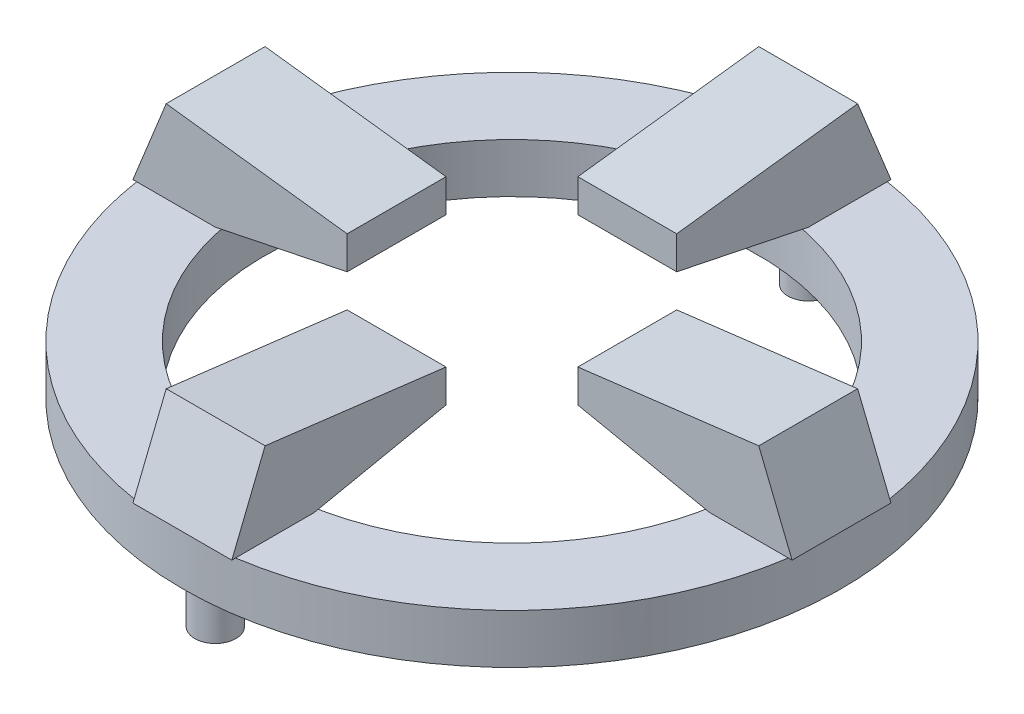
ISO-10303-21;
HEADER;
FILE_DESCRIPTION(('STEP AP214'),'2;1');
FILE_NAME('part.step','',(''),(''),'','','');
FILE_SCHEMA(('AUTOMOTIVE_DESIGN { 1 0 10303 214 1 1 1 1 }'));
ENDSEC;
DATA;
#1=APPLICATION_CONTEXT('core data for automotive mechanical design processes');
#2=APPLICATION_PROTOCOL_DEFINITION('international standard','automotive_design',2000,#1);
#3=PRODUCT_CONTEXT('',#1,'mechanical');
#4=PRODUCT('Part','Part','',(#3));
#5=PRODUCT_RELATED_PRODUCT_CATEGORY('part','',(#4));
#6=PRODUCT_DEFINITION_FORMATION('','',#4);
#7=PRODUCT_DEFINITION_CONTEXT('part definition',#1,'design');
#8=PRODUCT_DEFINITION('design','',#6,#7);
#9=PRODUCT_DEFINITION_SHAPE('','',#8);
#10=(LENGTH_UNIT() NAMED_UNIT(*) SI_UNIT(.MILLI.,.METRE.));
#11=(NAMED_UNIT(*) PLANE_ANGLE_UNIT() SI_UNIT($,.RADIAN.));
#12=(NAMED_UNIT(*) SI_UNIT($,.STERADIAN.) SOLID_ANGLE_UNIT());
#13=UNCERTAINTY_MEASURE_WITH_UNIT(LENGTH_MEASURE(1.E-05),#10,'distance_accuracy_value','');
#14=(GEOMETRIC_REPRESENTATION_CONTEXT(3) GLOBAL_UNCERTAINTY_ASSIGNED_CONTEXT((#13)) GLOBAL_UNIT_ASSIGNED_CONTEXT((#10,
#11,#12)) REPRESENTATION_CONTEXT('',''));
#15=CARTESIAN_POINT('',(0.,0.,0.));
#16=DIRECTION('',(0.,0.,1.));
#17=DIRECTION('',(1.,0.,0.));
#18=AXIS2_PLACEMENT_3D('',#15,#16,#17);
#19=CARTESIAN_POINT('',(0.,3.,0.));
#20=DIRECTION('',(0.,1.,0.));
#21=DIRECTION('',(0.,0.,1.));
#22=AXIS2_PLACEMENT_3D('',#19,#20,#21);
#23=PLANE('',#22);
#24=DIRECTION('',(1.,0.,0.));
#25=VECTOR('',#24,1.);
#26=CARTESIAN_POINT('',(-15.,3.,-3.));
#27=LINE('',#26,#25);
#28=CARTESIAN_POINT('',(-19.7737199332852,3.,-3.));
#29=VERTEX_POINT('',#28);
#30=CARTESIAN_POINT('',(-15.,3.,-3.));
#31=VERTEX_POINT('',#30);
#32=EDGE_CURVE('E61',#29,#31,#27,.T.);
#33=ORIENTED_EDGE('',*,*,#32,.T.);
#34=DIRECTION('',(0.,0.,1.));
#35=VECTOR('',#34,1.);
#36=CARTESIAN_POINT('',(-15.,3.,-3.));
#37=LINE('',#36,#35);
#38=CARTESIAN_POINT('',(-15.,3.,0.));
#39=VERTEX_POINT('',#38);
#40=EDGE_CURVE('E258',#31,#39,#37,.T.);
#41=ORIENTED_EDGE('',*,*,#40,.T.);
#42=CARTESIAN_POINT('',(0.,3.,0.));
#43=DIRECTION('',(0.,1.,0.));
#44=DIRECTION('',(0.,0.,1.));
#45=AXIS2_PLACEMENT_3D('',#42,#43,#44);
#46=CIRCLE('',#45,15.);
#47=CARTESIAN_POINT('',(0.,3.,-15.));
#48=VERTEX_POINT('',#47);
#49=EDGE_CURVE('E491',#48,#39,#46,.T.);
#50=ORIENTED_EDGE('',*,*,#49,.F.);
#51=DIRECTION('',(1.,0.,0.));
#52=VECTOR('',#51,1.);
#53=CARTESIAN_POINT('',(-3.,3.,-15.));
#54=LINE('',#53,#52);
#55=CARTESIAN_POINT('',(-3.,3.,-15.));
#56=VERTEX_POINT('',#55);
#57=EDGE_CURVE('E472',#56,#48,#54,.T.);
#58=ORIENTED_EDGE('',*,*,#57,.F.);
#59=DIRECTION('',(0.,0.,-1.));
#60=VECTOR('',#59,1.);
#61=CARTESIAN_POINT('',(-3.,3.,-15.));
#62=LINE('',#61,#60);
#63=CARTESIAN_POINT('',(-3.,3.,-19.7737199332852));
#64=VERTEX_POINT('',#63);
#65=EDGE_CURVE('E451',#56,#64,#62,.T.);
#66=ORIENTED_EDGE('',*,*,#65,.T.);
#67=CARTESIAN_POINT('',(0.,3.,0.));
#68=DIRECTION('',(0.,1.,0.));
#69=DIRECTION('',(0.,0.,1.));
#70=AXIS2_PLACEMENT_3D('',#67,#68,#69);
#71=CIRCLE('',#70,20.);
#72=EDGE_CURVE('E1092',#64,#29,#71,.T.);
#73=ORIENTED_EDGE('',*,*,#72,.T.);
#74=EDGE_LOOP('',(#33,#41,#50,#58,#66,#73));
#75=FACE_BOUND('',#74,.T.);
#76=ADVANCED_FACE('F45',(#75),#23,.T.);
#77=DIRECTION('',(1.,0.,0.));
#78=VECTOR('',#77,1.);
#79=CARTESIAN_POINT('',(15.,3.,-3.));
#80=LINE('',#79,#78);
#81=CARTESIAN_POINT('',(15.,3.,-3.));
#82=VERTEX_POINT('',#81);
#83=CARTESIAN_POINT('',(19.7737199332852,3.,-3.));
#84=VERTEX_POINT('',#83);
#85=EDGE_CURVE('E321',#82,#84,#80,.T.);
#86=ORIENTED_EDGE('',*,*,#85,.T.);
#87=CARTESIAN_POINT('',(3.,3.,-19.7737199332852));
#88=VERTEX_POINT('',#87);
#89=EDGE_CURVE('E509',#84,#88,#71,.T.);
#90=ORIENTED_EDGE('',*,*,#89,.T.);
#91=DIRECTION('',(0.,0.,-1.));
#92=VECTOR('',#91,1.);
#93=CARTESIAN_POINT('',(3.,3.,-15.));
#94=LINE('',#93,#92);
#95=CARTESIAN_POINT('',(3.,3.,-15.));
#96=VERTEX_POINT('',#95);
#97=EDGE_CURVE('E429',#96,#88,#94,.T.);
#98=ORIENTED_EDGE('',*,*,#97,.F.);
#99=EDGE_CURVE('E478',#48,#96,#54,.T.);
#100=ORIENTED_EDGE('',*,*,#99,.F.);
#101=CARTESIAN_POINT('',(15.,3.,0.));
#102=VERTEX_POINT('',#101);
#103=EDGE_CURVE('E501',#102,#48,#46,.T.);
#104=ORIENTED_EDGE('',*,*,#103,.F.);
#105=DIRECTION('',(0.,0.,1.));
#106=VECTOR('',#105,1.);
#107=CARTESIAN_POINT('',(15.,3.,-3.));
#108=LINE('',#107,#106);
#109=EDGE_CURVE('E341',#82,#102,#108,.T.);
#110=ORIENTED_EDGE('',*,*,#109,.F.);
#111=EDGE_LOOP('',(#86,#90,#98,#100,#104,#110));
#112=FACE_BOUND('',#111,.T.);
#113=ADVANCED_FACE('F528',(#112),#23,.T.);
#114=CARTESIAN_POINT('',(-15.,3.,3.));
#115=VERTEX_POINT('',#114);
#116=EDGE_CURVE('E69',#39,#115,#37,.T.);
#117=ORIENTED_EDGE('',*,*,#116,.T.);
#118=DIRECTION('',(1.,0.,0.));
#119=VECTOR('',#118,1.);
#120=CARTESIAN_POINT('',(-15.,3.,3.));
#121=LINE('',#120,#119);
#122=CARTESIAN_POINT('',(-19.7737199332852,3.,3.));
#123=VERTEX_POINT('',#122);
#124=EDGE_CURVE('E280',#123,#115,#121,.T.);
#125=ORIENTED_EDGE('',*,*,#124,.F.);
#126=CARTESIAN_POINT('',(-3.,3.,19.7737199332852));
#127=VERTEX_POINT('',#126);
#128=EDGE_CURVE('E506',#123,#127,#71,.T.);
#129=ORIENTED_EDGE('',*,*,#128,.T.);
#130=DIRECTION('',(0.,0.,-1.));
#131=VECTOR('',#130,1.);
#132=CARTESIAN_POINT('',(-3.,3.,15.));
#133=LINE('',#132,#131);
#134=CARTESIAN_POINT('',(-3.,3.,15.));
#135=VERTEX_POINT('',#134);
#136=EDGE_CURVE('E386',#127,#135,#133,.T.);
#137=ORIENTED_EDGE('',*,*,#136,.T.);
#138=DIRECTION('',(1.,0.,0.));
#139=VECTOR('',#138,1.);
#140=CARTESIAN_POINT('',(-3.,3.,15.));
#141=LINE('',#140,#139);
#142=CARTESIAN_POINT('',(0.,3.,15.));
#143=VERTEX_POINT('',#142);
#144=EDGE_CURVE('E375',#135,#143,#141,.T.);
#145=ORIENTED_EDGE('',*,*,#144,.T.);
#146=EDGE_CURVE('E496',#39,#143,#46,.T.);
#147=ORIENTED_EDGE('',*,*,#146,.F.);
#148=EDGE_LOOP('',(#117,#125,#129,#137,#145,#147));
#149=FACE_BOUND('',#148,.T.);
#150=ADVANCED_FACE('F579',(#149),#23,.T.);
#151=CARTESIAN_POINT('',(15.,3.,3.));
#152=VERTEX_POINT('',#151);
#153=EDGE_CURVE('E346',#102,#152,#108,.T.);
#154=ORIENTED_EDGE('',*,*,#153,.F.);
#155=EDGE_CURVE('E497',#143,#102,#46,.T.);
#156=ORIENTED_EDGE('',*,*,#155,.F.);
#157=CARTESIAN_POINT('',(3.,3.,15.));
#158=VERTEX_POINT('',#157);
#159=EDGE_CURVE('E379',#143,#158,#141,.T.);
#160=ORIENTED_EDGE('',*,*,#159,.T.);
#161=DIRECTION('',(0.,0.,-1.));
#162=VECTOR('',#161,1.);
#163=CARTESIAN_POINT('',(3.,3.,15.));
#164=LINE('',#163,#162);
#165=CARTESIAN_POINT('',(3.,3.,19.7737199332852));
#166=VERTEX_POINT('',#165);
#167=EDGE_CURVE('E407',#166,#158,#164,.T.);
#168=ORIENTED_EDGE('',*,*,#167,.F.);
#169=CARTESIAN_POINT('',(19.7737199332852,3.,3.));
#170=VERTEX_POINT('',#169);
#171=EDGE_CURVE('E535',#166,#170,#71,.T.);
#172=ORIENTED_EDGE('',*,*,#171,.T.);
#173=DIRECTION('',(1.,0.,0.));
#174=VECTOR('',#173,1.);
#175=CARTESIAN_POINT('',(15.,3.,3.));
#176=LINE('',#175,#174);
#177=EDGE_CURVE('E299',#152,#170,#176,.T.);
#178=ORIENTED_EDGE('',*,*,#177,.F.);
#179=EDGE_LOOP('',(#154,#156,#160,#168,#172,#178));
#180=FACE_BOUND('',#179,.T.);
#181=ADVANCED_FACE('F582',(#180),#23,.T.);
#182=CARTESIAN_POINT('',(0.,0.,0.));
#183=DIRECTION('',(0.,1.,0.));
#184=DIRECTION('',(0.,0.,1.));
#185=AXIS2_PLACEMENT_3D('',#182,#183,#184);
#186=PLANE('',#185);
#187=CARTESIAN_POINT('',(0.,0.,-18.));
#188=DIRECTION('',(0.,1.,0.));
#189=DIRECTION('',(0.,0.,1.));
#190=AXIS2_PLACEMENT_3D('',#187,#188,#189);
#191=CIRCLE('',#190,1.25);
#192=CARTESIAN_POINT('',(0.,0.,-16.75));
#193=VERTEX_POINT('',#192);
#194=EDGE_CURVE('E11',#193,#193,#191,.F.);
#195=ORIENTED_EDGE('',*,*,#194,.F.);
#196=EDGE_LOOP('',(#195));
#197=FACE_BOUND('',#196,.T.);
#198=CARTESIAN_POINT('',(0.,0.,18.));
#199=DIRECTION('',(0.,1.,0.));
#200=DIRECTION('',(0.,0.,1.));
#201=AXIS2_PLACEMENT_3D('',#198,#199,#200);
#202=CIRCLE('',#201,1.25);
#203=CARTESIAN_POINT('',(0.,0.,19.25));
#204=VERTEX_POINT('',#203);
#205=EDGE_CURVE('E54',#204,#204,#202,.F.);
#206=ORIENTED_EDGE('',*,*,#205,.F.);
#207=EDGE_LOOP('',(#206));
#208=FACE_BOUND('',#207,.T.);
#209=CARTESIAN_POINT('',(0.,0.,0.));
#210=DIRECTION('',(0.,1.,0.));
#211=DIRECTION('',(0.,0.,1.));
#212=AXIS2_PLACEMENT_3D('',#209,#210,#211);
#213=CIRCLE('',#212,20.);
#214=CARTESIAN_POINT('',(0.,0.,20.));
#215=VERTEX_POINT('',#214);
#216=EDGE_CURVE('E495',#215,#215,#213,.T.);
#217=ORIENTED_EDGE('',*,*,#216,.F.);
#218=EDGE_LOOP('',(#217));
#219=FACE_BOUND('',#218,.T.);
#220=CARTESIAN_POINT('',(0.,0.,0.));
#221=DIRECTION('',(0.,1.,0.));
#222=DIRECTION('',(0.,0.,1.));
#223=AXIS2_PLACEMENT_3D('',#220,#221,#222);
#224=CIRCLE('',#223,15.);
#225=CARTESIAN_POINT('',(0.,0.,15.));
#226=VERTEX_POINT('',#225);
#227=EDGE_CURVE('E476',#226,#226,#224,.T.);
#228=ORIENTED_EDGE('',*,*,#227,.T.);
#229=EDGE_LOOP('',(#228));
#230=FACE_BOUND('',#229,.T.);
#231=ADVANCED_FACE('F654',(#197,#208,#219,#230),#186,.F.);
#232=CARTESIAN_POINT('',(0.,3.,0.));
#233=DIRECTION('',(0.,-1.,0.));
#234=DIRECTION('',(0.,0.,-1.));
#235=AXIS2_PLACEMENT_3D('',#232,#233,#234);
#236=CYLINDRICAL_SURFACE('',#235,20.);
#237=CARTESIAN_POINT('',(0.,3.,-20.));
#238=VERTEX_POINT('',#237);
#239=EDGE_CURVE('E502',#88,#238,#71,.T.);
#240=ORIENTED_EDGE('',*,*,#239,.F.);
#241=ORIENTED_EDGE('',*,*,#89,.F.);
#242=CARTESIAN_POINT('',(0.,3.,0.));
#243=DIRECTION('',(0.,-1.,0.));
#244=DIRECTION('',(0.,0.,-1.));
#245=AXIS2_PLACEMENT_3D('',#242,#243,#244);
#246=CIRCLE('',#245,20.);
#247=CARTESIAN_POINT('',(20.,2.99999999999999,0.));
#248=VERTEX_POINT('',#247);
#249=EDGE_CURVE('E362',#84,#248,#246,.T.);
#250=ORIENTED_EDGE('',*,*,#249,.T.);
#251=EDGE_CURVE('E345',#248,#170,#246,.T.);
#252=ORIENTED_EDGE('',*,*,#251,.T.);
#253=ORIENTED_EDGE('',*,*,#171,.F.);
#254=CARTESIAN_POINT('',(0.,3.,0.));
#255=DIRECTION('',(0.,-1.,0.));
#256=DIRECTION('',(0.,0.,-1.));
#257=AXIS2_PLACEMENT_3D('',#254,#255,#256);
#258=CIRCLE('',#257,20.);
#259=CARTESIAN_POINT('',(0.,3.,20.));
#260=VERTEX_POINT('',#259);
#261=EDGE_CURVE('E428',#166,#260,#258,.T.);
#262=ORIENTED_EDGE('',*,*,#261,.T.);
#263=EDGE_CURVE('E424',#260,#127,#258,.T.);
#264=ORIENTED_EDGE('',*,*,#263,.T.);
#265=ORIENTED_EDGE('',*,*,#128,.F.);
#266=CARTESIAN_POINT('',(0.,3.,0.));
#267=DIRECTION('',(0.,-1.,0.));
#268=DIRECTION('',(0.,0.,-1.));
#269=AXIS2_PLACEMENT_3D('',#266,#267,#268);
#270=CIRCLE('',#269,20.);
#271=CARTESIAN_POINT('',(-20.,2.99999999999999,0.));
#272=VERTEX_POINT('',#271);
#273=EDGE_CURVE('E298',#123,#272,#270,.T.);
#274=ORIENTED_EDGE('',*,*,#273,.T.);
#275=EDGE_CURVE('E295',#272,#29,#270,.T.);
#276=ORIENTED_EDGE('',*,*,#275,.T.);
#277=ORIENTED_EDGE('',*,*,#72,.F.);
#278=EDGE_CURVE('E505',#238,#64,#71,.T.);
#279=ORIENTED_EDGE('',*,*,#278,.F.);
#280=EDGE_LOOP('',(#240,#241,#250,#252,#253,#262,#264,#265,#274,#276,#277,#279));
#281=FACE_BOUND('',#280,.T.);
#282=ORIENTED_EDGE('',*,*,#216,.T.);
#283=EDGE_LOOP('',(#282));
#284=FACE_BOUND('',#283,.T.);
#285=ADVANCED_FACE('F47',(#281,#284),#236,.T.);
#286=CARTESIAN_POINT('',(0.,3.,0.));
#287=DIRECTION('',(0.,-1.,0.));
#288=DIRECTION('',(0.,0.,-1.));
#289=AXIS2_PLACEMENT_3D('',#286,#287,#288);
#290=CYLINDRICAL_SURFACE('',#289,15.);
#291=ORIENTED_EDGE('',*,*,#49,.T.);
#292=ORIENTED_EDGE('',*,*,#146,.T.);
#293=ORIENTED_EDGE('',*,*,#155,.T.);
#294=ORIENTED_EDGE('',*,*,#103,.T.);
#295=EDGE_LOOP('',(#291,#292,#293,#294));
#296=FACE_BOUND('',#295,.T.);
#297=ORIENTED_EDGE('',*,*,#227,.F.);
#298=EDGE_LOOP('',(#297));
#299=FACE_BOUND('',#298,.T.);
#300=ADVANCED_FACE('F589',(#296,#299),#290,.F.);
#301=CARTESIAN_POINT('',(-3.,3.,-15.));
#302=DIRECTION('',(0.,-1.,0.));
#303=DIRECTION('',(0.,0.,-1.));
#304=AXIS2_PLACEMENT_3D('',#301,#302,#303);
#305=PLANE('',#304);
#306=CARTESIAN_POINT('',(3.,3.,-20.));
#307=VERTEX_POINT('',#306);
#308=EDGE_CURVE('E434',#88,#307,#94,.T.);
#309=ORIENTED_EDGE('',*,*,#308,.F.);
#310=ORIENTED_EDGE('',*,*,#239,.T.);
#311=DIRECTION('',(1.,0.,0.));
#312=VECTOR('',#311,1.);
#313=CARTESIAN_POINT('',(-3.,3.,-20.));
#314=LINE('',#313,#312);
#315=EDGE_CURVE('E471',#238,#307,#314,.T.);
#316=ORIENTED_EDGE('',*,*,#315,.T.);
#317=EDGE_LOOP('',(#309,#310,#316));
#318=FACE_BOUND('',#317,.T.);
#319=ADVANCED_FACE('F538',(#318),#305,.T.);
#320=CARTESIAN_POINT('',(-3.,3.,-20.));
#321=VERTEX_POINT('',#320);
#322=EDGE_CURVE('E487',#321,#238,#314,.T.);
#323=ORIENTED_EDGE('',*,*,#322,.T.);
#324=ORIENTED_EDGE('',*,*,#278,.T.);
#325=EDGE_CURVE('E450',#64,#321,#62,.T.);
#326=ORIENTED_EDGE('',*,*,#325,.T.);
#327=EDGE_LOOP('',(#323,#324,#326));
#328=FACE_BOUND('',#327,.T.);
#329=ADVANCED_FACE('F667',(#328),#305,.T.);
#330=CARTESIAN_POINT('',(-3.,4.65184162192437,-7.));
#331=DIRECTION('',(0.,-0.979341240081058,0.202214577804114));
#332=DIRECTION('',(0.,-0.202214577804114,-0.979341240081058));
#333=AXIS2_PLACEMENT_3D('',#330,#331,#332);
#334=PLANE('',#333);
#335=ORIENTED_EDGE('',*,*,#57,.T.);
#336=ORIENTED_EDGE('',*,*,#99,.T.);
#337=DIRECTION('',(0.,-0.202214577804115,-0.979341240081058));
#338=VECTOR('',#337,1.);
#339=CARTESIAN_POINT('',(3.,4.65184162192437,-7.));
#340=LINE('',#339,#338);
#341=CARTESIAN_POINT('',(3.,4.65184162192437,-7.));
#342=VERTEX_POINT('',#341);
#343=EDGE_CURVE('E446',#342,#96,#340,.T.);
#344=ORIENTED_EDGE('',*,*,#343,.F.);
#345=DIRECTION('',(1.,0.,0.));
#346=VECTOR('',#345,1.);
#347=CARTESIAN_POINT('',(-3.,4.65184162192437,-7.));
#348=LINE('',#347,#346);
#349=CARTESIAN_POINT('',(-3.,4.65184162192437,-7.));
#350=VERTEX_POINT('',#349);
#351=EDGE_CURVE('E477',#350,#342,#348,.T.);
#352=ORIENTED_EDGE('',*,*,#351,.F.);
#353=DIRECTION('',(0.,-0.202214577804115,-0.979341240081058));
#354=VECTOR('',#353,1.);
#355=CARTESIAN_POINT('',(-3.,4.65184162192437,-7.));
#356=LINE('',#355,#354);
#357=EDGE_CURVE('E467',#350,#56,#356,.T.);
#358=ORIENTED_EDGE('',*,*,#357,.T.);
#359=EDGE_LOOP('',(#335,#336,#344,#352,#358));
#360=FACE_BOUND('',#359,.T.);
#361=ADVANCED_FACE('F518',(#360),#334,.T.);
#362=CARTESIAN_POINT('',(-3.,6.65184162192437,-7.));
#363=DIRECTION('',(0.,0.,1.));
#364=DIRECTION('',(1.,0.,0.));
#365=AXIS2_PLACEMENT_3D('',#362,#363,#364);
#366=PLANE('',#365);
#367=ORIENTED_EDGE('',*,*,#351,.T.);
#368=DIRECTION('',(0.,-1.,0.));
#369=VECTOR('',#368,1.);
#370=CARTESIAN_POINT('',(3.,6.65184162192437,-7.));
#371=LINE('',#370,#369);
#372=CARTESIAN_POINT('',(3.,6.65184162192437,-7.));
#373=VERTEX_POINT('',#372);
#374=EDGE_CURVE('E442',#373,#342,#371,.T.);
#375=ORIENTED_EDGE('',*,*,#374,.F.);
#376=DIRECTION('',(1.,0.,0.));
#377=VECTOR('',#376,1.);
#378=CARTESIAN_POINT('',(-3.,6.65184162192437,-7.));
#379=LINE('',#378,#377);
#380=CARTESIAN_POINT('',(-3.,6.65184162192437,-7.));
#381=VERTEX_POINT('',#380);
#382=EDGE_CURVE('E481',#381,#373,#379,.T.);
#383=ORIENTED_EDGE('',*,*,#382,.F.);
#384=DIRECTION('',(0.,-1.,0.));
#385=VECTOR('',#384,1.);
#386=CARTESIAN_POINT('',(-3.,6.65184162192437,-7.));
#387=LINE('',#386,#385);
#388=EDGE_CURVE('E463',#381,#350,#387,.T.);
#389=ORIENTED_EDGE('',*,*,#388,.T.);
#390=EDGE_LOOP('',(#367,#375,#383,#389));
#391=FACE_BOUND('',#390,.T.);
#392=ADVANCED_FACE('F806',(#391),#366,.T.);
#393=CARTESIAN_POINT('',(-3.,8.,-17.9798688708242));
#394=DIRECTION('',(0.,0.992546151641322,0.121869343405148));
#395=DIRECTION('',(0.,-0.121869343405148,0.992546151641322));
#396=AXIS2_PLACEMENT_3D('',#393,#394,#395);
#397=PLANE('',#396);
#398=ORIENTED_EDGE('',*,*,#382,.T.);
#399=DIRECTION('',(0.,-0.121869343405148,0.992546151641322));
#400=VECTOR('',#399,1.);
#401=CARTESIAN_POINT('',(3.,8.,-17.9798688708242));
#402=LINE('',#401,#400);
#403=CARTESIAN_POINT('',(3.,8.,-17.9798688708242));
#404=VERTEX_POINT('',#403);
#405=EDGE_CURVE('E438',#404,#373,#402,.T.);
#406=ORIENTED_EDGE('',*,*,#405,.F.);
#407=DIRECTION('',(1.,0.,0.));
#408=VECTOR('',#407,1.);
#409=CARTESIAN_POINT('',(-3.,8.,-17.9798688708242));
#410=LINE('',#409,#408);
#411=CARTESIAN_POINT('',(-3.,8.,-17.9798688708242));
#412=VERTEX_POINT('',#411);
#413=EDGE_CURVE('E484',#412,#404,#410,.T.);
#414=ORIENTED_EDGE('',*,*,#413,.F.);
#415=DIRECTION('',(0.,-0.121869343405148,0.992546151641322));
#416=VECTOR('',#415,1.);
#417=CARTESIAN_POINT('',(-3.,8.,-17.9798688708242));
#418=LINE('',#417,#416);
#419=EDGE_CURVE('E459',#412,#381,#418,.T.);
#420=ORIENTED_EDGE('',*,*,#419,.T.);
#421=EDGE_LOOP('',(#398,#406,#414,#420));
#422=FACE_BOUND('',#421,.T.);
#423=ADVANCED_FACE('F795',(#422),#397,.T.);
#424=CARTESIAN_POINT('',(-3.,3.,-20.));
#425=DIRECTION('',(0.,0.37460659341591,-0.927183854566789));
#426=DIRECTION('',(0.,0.927183854566789,0.37460659341591));
#427=AXIS2_PLACEMENT_3D('',#424,#425,#426);
#428=PLANE('',#427);
#429=ORIENTED_EDGE('',*,*,#413,.T.);
#430=DIRECTION('',(0.,0.927183854566788,0.37460659341591));
#431=VECTOR('',#430,1.);
#432=CARTESIAN_POINT('',(3.,3.,-20.));
#433=LINE('',#432,#431);
#434=EDGE_CURVE('E433',#307,#404,#433,.T.);
#435=ORIENTED_EDGE('',*,*,#434,.F.);
#436=ORIENTED_EDGE('',*,*,#315,.F.);
#437=ORIENTED_EDGE('',*,*,#322,.F.);
#438=DIRECTION('',(0.,0.927183854566788,0.37460659341591));
#439=VECTOR('',#438,1.);
#440=CARTESIAN_POINT('',(-3.,3.,-20.));
#441=LINE('',#440,#439);
#442=EDGE_CURVE('E455',#321,#412,#441,.T.);
#443=ORIENTED_EDGE('',*,*,#442,.T.);
#444=EDGE_LOOP('',(#429,#435,#436,#437,#443));
#445=FACE_BOUND('',#444,.T.);
#446=ADVANCED_FACE('F784',(#445),#428,.T.);
#447=CARTESIAN_POINT('',(-3.,0.,0.));
#448=DIRECTION('',(-1.,0.,0.));
#449=DIRECTION('',(0.,0.,1.));
#450=AXIS2_PLACEMENT_3D('',#447,#448,#449);
#451=PLANE('',#450);
#452=ORIENTED_EDGE('',*,*,#65,.F.);
#453=ORIENTED_EDGE('',*,*,#357,.F.);
#454=ORIENTED_EDGE('',*,*,#388,.F.);
#455=ORIENTED_EDGE('',*,*,#419,.F.);
#456=ORIENTED_EDGE('',*,*,#442,.F.);
#457=ORIENTED_EDGE('',*,*,#325,.F.);
#458=EDGE_LOOP('',(#452,#453,#454,#455,#456,#457));
#459=FACE_BOUND('',#458,.T.);
#460=ADVANCED_FACE('F774',(#459),#451,.T.);
#461=CARTESIAN_POINT('',(3.,0.,0.));
#462=DIRECTION('',(-1.,0.,0.));
#463=DIRECTION('',(0.,0.,1.));
#464=AXIS2_PLACEMENT_3D('',#461,#462,#463);
#465=PLANE('',#464);
#466=ORIENTED_EDGE('',*,*,#97,.T.);
#467=ORIENTED_EDGE('',*,*,#308,.T.);
#468=ORIENTED_EDGE('',*,*,#434,.T.);
#469=ORIENTED_EDGE('',*,*,#405,.T.);
#470=ORIENTED_EDGE('',*,*,#374,.T.);
#471=ORIENTED_EDGE('',*,*,#343,.T.);
#472=EDGE_LOOP('',(#466,#467,#468,#469,#470,#471));
#473=FACE_BOUND('',#472,.T.);
#474=ADVANCED_FACE('F525',(#473),#465,.F.);
#475=CARTESIAN_POINT('',(-3.,3.,15.));
#476=DIRECTION('',(0.,-1.,0.));
#477=DIRECTION('',(0.,0.,-1.));
#478=AXIS2_PLACEMENT_3D('',#475,#476,#477);
#479=PLANE('',#478);
#480=ORIENTED_EDGE('',*,*,#261,.F.);
#481=CARTESIAN_POINT('',(3.,3.,20.));
#482=VERTEX_POINT('',#481);
#483=EDGE_CURVE('E408',#482,#166,#164,.T.);
#484=ORIENTED_EDGE('',*,*,#483,.F.);
#485=DIRECTION('',(1.,0.,0.));
#486=VECTOR('',#485,1.);
#487=CARTESIAN_POINT('',(-3.,3.,20.));
#488=LINE('',#487,#486);
#489=EDGE_CURVE('E374',#260,#482,#488,.T.);
#490=ORIENTED_EDGE('',*,*,#489,.F.);
#491=EDGE_LOOP('',(#480,#484,#490));
#492=FACE_BOUND('',#491,.T.);
#493=ADVANCED_FACE('F556',(#492),#479,.T.);
#494=CARTESIAN_POINT('',(-3.,6.65184162192437,7.));
#495=DIRECTION('',(0.,0.,-1.));
#496=DIRECTION('',(-1.,0.,0.));
#497=AXIS2_PLACEMENT_3D('',#494,#495,#496);
#498=PLANE('',#497);
#499=DIRECTION('',(1.,0.,0.));
#500=VECTOR('',#499,1.);
#501=CARTESIAN_POINT('',(-3.,6.65184162192437,7.));
#502=LINE('',#501,#500);
#503=CARTESIAN_POINT('',(-3.,6.65184162192437,7.));
#504=VERTEX_POINT('',#503);
#505=CARTESIAN_POINT('',(3.,6.65184162192437,7.));
#506=VERTEX_POINT('',#505);
#507=EDGE_CURVE('E363',#504,#506,#502,.T.);
#508=ORIENTED_EDGE('',*,*,#507,.T.);
#509=DIRECTION('',(0.,1.,0.));
#510=VECTOR('',#509,1.);
#511=CARTESIAN_POINT('',(3.,6.65184162192437,7.));
#512=LINE('',#511,#510);
#513=CARTESIAN_POINT('',(3.,4.65184162192437,7.));
#514=VERTEX_POINT('',#513);
#515=EDGE_CURVE('E420',#514,#506,#512,.T.);
#516=ORIENTED_EDGE('',*,*,#515,.F.);
#517=DIRECTION('',(1.,0.,0.));
#518=VECTOR('',#517,1.);
#519=CARTESIAN_POINT('',(-3.,4.65184162192437,7.));
#520=LINE('',#519,#518);
#521=CARTESIAN_POINT('',(-3.,4.65184162192437,7.));
#522=VERTEX_POINT('',#521);
#523=EDGE_CURVE('E380',#522,#514,#520,.T.);
#524=ORIENTED_EDGE('',*,*,#523,.F.);
#525=DIRECTION('',(0.,1.,0.));
#526=VECTOR('',#525,1.);
#527=CARTESIAN_POINT('',(-3.,6.65184162192437,7.));
#528=LINE('',#527,#526);
#529=EDGE_CURVE('E399',#522,#504,#528,.T.);
#530=ORIENTED_EDGE('',*,*,#529,.T.);
#531=EDGE_LOOP('',(#508,#516,#524,#530));
#532=FACE_BOUND('',#531,.T.);
#533=ADVANCED_FACE('F571',(#532),#498,.T.);
#534=CARTESIAN_POINT('',(-3.,4.65184162192437,7.));
#535=DIRECTION('',(0.,-0.979341240081058,-0.202214577804114));
#536=DIRECTION('',(0.,0.202214577804114,-0.979341240081058));
#537=AXIS2_PLACEMENT_3D('',#534,#535,#536);
#538=PLANE('',#537);
#539=ORIENTED_EDGE('',*,*,#523,.T.);
#540=DIRECTION('',(0.,0.202214577804115,-0.979341240081058));
#541=VECTOR('',#540,1.);
#542=CARTESIAN_POINT('',(3.,4.65184162192437,7.));
#543=LINE('',#542,#541);
#544=EDGE_CURVE('E403',#158,#514,#543,.T.);
#545=ORIENTED_EDGE('',*,*,#544,.F.);
#546=ORIENTED_EDGE('',*,*,#159,.F.);
#547=ORIENTED_EDGE('',*,*,#144,.F.);
#548=DIRECTION('',(0.,0.202214577804115,-0.979341240081058));
#549=VECTOR('',#548,1.);
#550=CARTESIAN_POINT('',(-3.,4.65184162192437,7.));
#551=LINE('',#550,#549);
#552=EDGE_CURVE('E366',#135,#522,#551,.T.);
#553=ORIENTED_EDGE('',*,*,#552,.T.);
#554=EDGE_LOOP('',(#539,#545,#546,#547,#553));
#555=FACE_BOUND('',#554,.T.);
#556=ADVANCED_FACE('F575',(#555),#538,.T.);
#557=ORIENTED_EDGE('',*,*,#263,.F.);
#558=CARTESIAN_POINT('',(-3.,3.,20.));
#559=VERTEX_POINT('',#558);
#560=EDGE_CURVE('E370',#559,#260,#488,.T.);
#561=ORIENTED_EDGE('',*,*,#560,.F.);
#562=EDGE_CURVE('E387',#559,#127,#133,.T.);
#563=ORIENTED_EDGE('',*,*,#562,.T.);
#564=EDGE_LOOP('',(#557,#561,#563));
#565=FACE_BOUND('',#564,.T.);
#566=ADVANCED_FACE('F554',(#565),#479,.T.);
#567=CARTESIAN_POINT('',(-3.,3.,20.));
#568=DIRECTION('',(0.,0.37460659341591,0.927183854566789));
#569=DIRECTION('',(0.,-0.927183854566789,0.37460659341591));
#570=AXIS2_PLACEMENT_3D('',#567,#568,#569);
#571=PLANE('',#570);
#572=ORIENTED_EDGE('',*,*,#560,.T.);
#573=ORIENTED_EDGE('',*,*,#489,.T.);
#574=DIRECTION('',(0.,-0.927183854566788,0.37460659341591));
#575=VECTOR('',#574,1.);
#576=CARTESIAN_POINT('',(3.,3.,20.));
#577=LINE('',#576,#575);
#578=CARTESIAN_POINT('',(3.,8.,17.9798688708242));
#579=VERTEX_POINT('',#578);
#580=EDGE_CURVE('E412',#579,#482,#577,.T.);
#581=ORIENTED_EDGE('',*,*,#580,.F.);
#582=DIRECTION('',(1.,0.,0.));
#583=VECTOR('',#582,1.);
#584=CARTESIAN_POINT('',(-3.,8.,17.9798688708242));
#585=LINE('',#584,#583);
#586=CARTESIAN_POINT('',(-3.,8.,17.9798688708242));
#587=VERTEX_POINT('',#586);
#588=EDGE_CURVE('E367',#587,#579,#585,.T.);
#589=ORIENTED_EDGE('',*,*,#588,.F.);
#590=DIRECTION('',(0.,-0.927183854566788,0.37460659341591));
#591=VECTOR('',#590,1.);
#592=CARTESIAN_POINT('',(-3.,3.,20.));
#593=LINE('',#592,#591);
#594=EDGE_CURVE('E391',#587,#559,#593,.T.);
#595=ORIENTED_EDGE('',*,*,#594,.T.);
#596=EDGE_LOOP('',(#572,#573,#581,#589,#595));
#597=FACE_BOUND('',#596,.T.);
#598=ADVANCED_FACE('F560',(#597),#571,.T.);
#599=CARTESIAN_POINT('',(-3.,8.,17.9798688708242));
#600=DIRECTION('',(0.,0.992546151641322,-0.121869343405148));
#601=DIRECTION('',(0.,0.121869343405148,0.992546151641322));
#602=AXIS2_PLACEMENT_3D('',#599,#600,#601);
#603=PLANE('',#602);
#604=ORIENTED_EDGE('',*,*,#588,.T.);
#605=DIRECTION('',(0.,0.121869343405148,0.992546151641322));
#606=VECTOR('',#605,1.);
#607=CARTESIAN_POINT('',(3.,8.,17.9798688708242));
#608=LINE('',#607,#606);
#609=EDGE_CURVE('E416',#506,#579,#608,.T.);
#610=ORIENTED_EDGE('',*,*,#609,.F.);
#611=ORIENTED_EDGE('',*,*,#507,.F.);
#612=DIRECTION('',(0.,0.121869343405148,0.992546151641322));
#613=VECTOR('',#612,1.);
#614=CARTESIAN_POINT('',(-3.,8.,17.9798688708242));
#615=LINE('',#614,#613);
#616=EDGE_CURVE('E395',#504,#587,#615,.T.);
#617=ORIENTED_EDGE('',*,*,#616,.T.);
#618=EDGE_LOOP('',(#604,#610,#611,#617));
#619=FACE_BOUND('',#618,.T.);
#620=ADVANCED_FACE('F567',(#619),#603,.T.);
#621=CARTESIAN_POINT('',(-3.,0.,0.));
#622=DIRECTION('',(-1.,0.,0.));
#623=DIRECTION('',(0.,0.,1.));
#624=AXIS2_PLACEMENT_3D('',#621,#622,#623);
#625=PLANE('',#624);
#626=ORIENTED_EDGE('',*,*,#529,.F.);
#627=ORIENTED_EDGE('',*,*,#552,.F.);
#628=ORIENTED_EDGE('',*,*,#136,.F.);
#629=ORIENTED_EDGE('',*,*,#562,.F.);
#630=ORIENTED_EDGE('',*,*,#594,.F.);
#631=ORIENTED_EDGE('',*,*,#616,.F.);
#632=EDGE_LOOP('',(#626,#627,#628,#629,#630,#631));
#633=FACE_BOUND('',#632,.T.);
#634=ADVANCED_FACE('F565',(#633),#625,.T.);
#635=CARTESIAN_POINT('',(3.,0.,0.));
#636=DIRECTION('',(-1.,0.,0.));
#637=DIRECTION('',(0.,0.,1.));
#638=AXIS2_PLACEMENT_3D('',#635,#636,#637);
#639=PLANE('',#638);
#640=ORIENTED_EDGE('',*,*,#515,.T.);
#641=ORIENTED_EDGE('',*,*,#609,.T.);
#642=ORIENTED_EDGE('',*,*,#580,.T.);
#643=ORIENTED_EDGE('',*,*,#483,.T.);
#644=ORIENTED_EDGE('',*,*,#167,.T.);
#645=ORIENTED_EDGE('',*,*,#544,.T.);
#646=EDGE_LOOP('',(#640,#641,#642,#643,#644,#645));
#647=FACE_BOUND('',#646,.T.);
#648=ADVANCED_FACE('F696',(#647),#639,.F.);
#649=CARTESIAN_POINT('',(15.,3.,-3.));
#650=DIRECTION('',(0.,-1.,0.));
#651=DIRECTION('',(0.,0.,-1.));
#652=AXIS2_PLACEMENT_3D('',#649,#650,#651);
#653=PLANE('',#652);
#654=ORIENTED_EDGE('',*,*,#249,.F.);
#655=CARTESIAN_POINT('',(20.,3.,-3.));
#656=VERTEX_POINT('',#655);
#657=EDGE_CURVE('E320',#84,#656,#80,.T.);
#658=ORIENTED_EDGE('',*,*,#657,.T.);
#659=DIRECTION('',(0.,0.,1.));
#660=VECTOR('',#659,1.);
#661=CARTESIAN_POINT('',(20.,3.,-3.));
#662=LINE('',#661,#660);
#663=EDGE_CURVE('E356',#656,#248,#662,.T.);
#664=ORIENTED_EDGE('',*,*,#663,.T.);
#665=EDGE_LOOP('',(#654,#658,#664));
#666=FACE_BOUND('',#665,.T.);
#667=ADVANCED_FACE('F701',(#666),#653,.T.);
#668=ORIENTED_EDGE('',*,*,#251,.F.);
#669=CARTESIAN_POINT('',(20.,3.,3.));
#670=VERTEX_POINT('',#669);
#671=EDGE_CURVE('E340',#248,#670,#662,.T.);
#672=ORIENTED_EDGE('',*,*,#671,.T.);
#673=EDGE_CURVE('E304',#170,#670,#176,.T.);
#674=ORIENTED_EDGE('',*,*,#673,.F.);
#675=EDGE_LOOP('',(#668,#672,#674));
#676=FACE_BOUND('',#675,.T.);
#677=ADVANCED_FACE('F619',(#676),#653,.T.);
#678=CARTESIAN_POINT('',(7.,4.65184162192429,-3.));
#679=DIRECTION('',(-0.202214577804106,-0.979341240081059,0.));
#680=DIRECTION('',(0.979341240081059,-0.202214577804106,0.));
#681=AXIS2_PLACEMENT_3D('',#678,#679,#680);
#682=PLANE('',#681);
#683=ORIENTED_EDGE('',*,*,#109,.T.);
#684=ORIENTED_EDGE('',*,*,#153,.T.);
#685=DIRECTION('',(0.979341240081059,-0.202214577804106,0.));
#686=VECTOR('',#685,1.);
#687=CARTESIAN_POINT('',(7.,4.65184162192429,3.));
#688=LINE('',#687,#686);
#689=CARTESIAN_POINT('',(7.,4.65184162192429,3.));
#690=VERTEX_POINT('',#689);
#691=EDGE_CURVE('E316',#690,#152,#688,.T.);
#692=ORIENTED_EDGE('',*,*,#691,.F.);
#693=DIRECTION('',(0.,0.,1.));
#694=VECTOR('',#693,1.);
#695=CARTESIAN_POINT('',(7.,4.65184162192429,-3.));
#696=LINE('',#695,#694);
#697=CARTESIAN_POINT('',(7.,4.65184162192429,-3.));
#698=VERTEX_POINT('',#697);
#699=EDGE_CURVE('E347',#698,#690,#696,.T.);
#700=ORIENTED_EDGE('',*,*,#699,.F.);
#701=DIRECTION('',(0.979341240081059,-0.202214577804106,0.));
#702=VECTOR('',#701,1.);
#703=CARTESIAN_POINT('',(7.,4.65184162192429,-3.));
#704=LINE('',#703,#702);
#705=EDGE_CURVE('E336',#698,#82,#704,.T.);
#706=ORIENTED_EDGE('',*,*,#705,.T.);
#707=EDGE_LOOP('',(#683,#684,#692,#700,#706));
#708=FACE_BOUND('',#707,.T.);
#709=ADVANCED_FACE('F598',(#708),#682,.T.);
#710=CARTESIAN_POINT('',(7.,6.65184162192429,-3.));
#711=DIRECTION('',(-1.,0.,0.));
#712=DIRECTION('',(0.,0.,1.));
#713=AXIS2_PLACEMENT_3D('',#710,#711,#712);
#714=PLANE('',#713);
#715=ORIENTED_EDGE('',*,*,#699,.T.);
#716=DIRECTION('',(0.,-1.,0.));
#717=VECTOR('',#716,1.);
#718=CARTESIAN_POINT('',(7.,6.65184162192429,3.));
#719=LINE('',#718,#717);
#720=CARTESIAN_POINT('',(7.,6.65184162192429,3.));
#721=VERTEX_POINT('',#720);
#722=EDGE_CURVE('E312',#721,#690,#719,.T.);
#723=ORIENTED_EDGE('',*,*,#722,.F.);
#724=DIRECTION('',(0.,0.,1.));
#725=VECTOR('',#724,1.);
#726=CARTESIAN_POINT('',(7.,6.65184162192429,-3.));
#727=LINE('',#726,#725);
#728=CARTESIAN_POINT('',(7.,6.65184162192429,-3.));
#729=VERTEX_POINT('',#728);
#730=EDGE_CURVE('E350',#729,#721,#727,.T.);
#731=ORIENTED_EDGE('',*,*,#730,.F.);
#732=DIRECTION('',(0.,-1.,0.));
#733=VECTOR('',#732,1.);
#734=CARTESIAN_POINT('',(7.,6.65184162192429,-3.));
#735=LINE('',#734,#733);
#736=EDGE_CURVE('E332',#729,#698,#735,.T.);
#737=ORIENTED_EDGE('',*,*,#736,.T.);
#738=EDGE_LOOP('',(#715,#723,#731,#737));
#739=FACE_BOUND('',#738,.T.);
#740=ADVANCED_FACE('F602',(#739),#714,.T.);
#741=CARTESIAN_POINT('',(17.9798688708242,8.,-3.));
#742=DIRECTION('',(-0.121869343405155,0.992546151641321,0.));
#743=DIRECTION('',(-0.992546151641321,-0.121869343405155,0.));
#744=AXIS2_PLACEMENT_3D('',#741,#742,#743);
#745=PLANE('',#744);
#746=ORIENTED_EDGE('',*,*,#730,.T.);
#747=DIRECTION('',(-0.992546151641321,-0.121869343405155,0.));
#748=VECTOR('',#747,1.);
#749=CARTESIAN_POINT('',(17.9798688708242,8.,3.));
#750=LINE('',#749,#748);
#751=CARTESIAN_POINT('',(17.9798688708242,8.,3.));
#752=VERTEX_POINT('',#751);
#753=EDGE_CURVE('E308',#752,#721,#750,.T.);
#754=ORIENTED_EDGE('',*,*,#753,.F.);
#755=DIRECTION('',(0.,0.,1.));
#756=VECTOR('',#755,1.);
#757=CARTESIAN_POINT('',(17.9798688708242,8.,-3.));
#758=LINE('',#757,#756);
#759=CARTESIAN_POINT('',(17.9798688708242,8.,-3.));
#760=VERTEX_POINT('',#759);
#761=EDGE_CURVE('E353',#760,#752,#758,.T.);
#762=ORIENTED_EDGE('',*,*,#761,.F.);
#763=DIRECTION('',(-0.992546151641321,-0.121869343405155,0.));
#764=VECTOR('',#763,1.);
#765=CARTESIAN_POINT('',(17.9798688708242,8.,-3.));
#766=LINE('',#765,#764);
#767=EDGE_CURVE('E328',#760,#729,#766,.T.);
#768=ORIENTED_EDGE('',*,*,#767,.T.);
#769=EDGE_LOOP('',(#746,#754,#762,#768));
#770=FACE_BOUND('',#769,.T.);
#771=ADVANCED_FACE('F605',(#770),#745,.T.);
#772=CARTESIAN_POINT('',(20.,3.,-3.));
#773=DIRECTION('',(0.927183854566785,0.374606593415917,0.));
#774=DIRECTION('',(-0.374606593415917,0.927183854566786,0.));
#775=AXIS2_PLACEMENT_3D('',#772,#773,#774);
#776=PLANE('',#775);
#777=ORIENTED_EDGE('',*,*,#761,.T.);
#778=DIRECTION('',(-0.374606593415917,0.927183854566786,0.));
#779=VECTOR('',#778,1.);
#780=CARTESIAN_POINT('',(20.,3.,3.));
#781=LINE('',#780,#779);
#782=EDGE_CURVE('E303',#670,#752,#781,.T.);
#783=ORIENTED_EDGE('',*,*,#782,.F.);
#784=ORIENTED_EDGE('',*,*,#671,.F.);
#785=ORIENTED_EDGE('',*,*,#663,.F.);
#786=DIRECTION('',(-0.374606593415917,0.927183854566786,0.));
#787=VECTOR('',#786,1.);
#788=CARTESIAN_POINT('',(20.,3.,-3.));
#789=LINE('',#788,#787);
#790=EDGE_CURVE('E324',#656,#760,#789,.T.);
#791=ORIENTED_EDGE('',*,*,#790,.T.);
#792=EDGE_LOOP('',(#777,#783,#784,#785,#791));
#793=FACE_BOUND('',#792,.T.);
#794=ADVANCED_FACE('F609',(#793),#776,.T.);
#795=CARTESIAN_POINT('',(0.,0.,-3.));
#796=DIRECTION('',(0.,0.,-1.));
#797=DIRECTION('',(-1.,0.,0.));
#798=AXIS2_PLACEMENT_3D('',#795,#796,#797);
#799=PLANE('',#798);
#800=ORIENTED_EDGE('',*,*,#85,.F.);
#801=ORIENTED_EDGE('',*,*,#705,.F.);
#802=ORIENTED_EDGE('',*,*,#736,.F.);
#803=ORIENTED_EDGE('',*,*,#767,.F.);
#804=ORIENTED_EDGE('',*,*,#790,.F.);
#805=ORIENTED_EDGE('',*,*,#657,.F.);
#806=EDGE_LOOP('',(#800,#801,#802,#803,#804,#805));
#807=FACE_BOUND('',#806,.T.);
#808=ADVANCED_FACE('F595',(#807),#799,.T.);
#809=CARTESIAN_POINT('',(0.,0.,3.));
#810=DIRECTION('',(0.,0.,-1.));
#811=DIRECTION('',(-1.,0.,0.));
#812=AXIS2_PLACEMENT_3D('',#809,#810,#811);
#813=PLANE('',#812);
#814=ORIENTED_EDGE('',*,*,#177,.T.);
#815=ORIENTED_EDGE('',*,*,#673,.T.);
#816=ORIENTED_EDGE('',*,*,#782,.T.);
#817=ORIENTED_EDGE('',*,*,#753,.T.);
#818=ORIENTED_EDGE('',*,*,#722,.T.);
#819=ORIENTED_EDGE('',*,*,#691,.T.);
#820=EDGE_LOOP('',(#814,#815,#816,#817,#818,#819));
#821=FACE_BOUND('',#820,.T.);
#822=ADVANCED_FACE('F613',(#821),#813,.F.);
#823=CARTESIAN_POINT('',(-15.,3.,-3.));
#824=DIRECTION('',(0.,-1.,0.));
#825=DIRECTION('',(0.,0.,-1.));
#826=AXIS2_PLACEMENT_3D('',#823,#824,#825);
#827=PLANE('',#826);
#828=ORIENTED_EDGE('',*,*,#273,.F.);
#829=CARTESIAN_POINT('',(-20.,3.,3.));
#830=VERTEX_POINT('',#829);
#831=EDGE_CURVE('E281',#830,#123,#121,.T.);
#832=ORIENTED_EDGE('',*,*,#831,.F.);
#833=DIRECTION('',(0.,0.,1.));
#834=VECTOR('',#833,1.);
#835=CARTESIAN_POINT('',(-20.,3.,-3.));
#836=LINE('',#835,#834);
#837=EDGE_CURVE('E629',#272,#830,#836,.T.);
#838=ORIENTED_EDGE('',*,*,#837,.F.);
#839=EDGE_LOOP('',(#828,#832,#838));
#840=FACE_BOUND('',#839,.T.);
#841=ADVANCED_FACE('F966',(#840),#827,.T.);
#842=CARTESIAN_POINT('',(-7.,6.65184162192429,-3.));
#843=DIRECTION('',(1.,0.,0.));
#844=DIRECTION('',(0.,0.,-1.));
#845=AXIS2_PLACEMENT_3D('',#842,#843,#844);
#846=PLANE('',#845);
#847=DIRECTION('',(0.,0.,1.));
#848=VECTOR('',#847,1.);
#849=CARTESIAN_POINT('',(-7.,6.65184162192429,-3.));
#850=LINE('',#849,#848);
#851=CARTESIAN_POINT('',(-7.,6.65184162192429,-3.));
#852=VERTEX_POINT('',#851);
#853=CARTESIAN_POINT('',(-7.,6.65184162192429,3.));
#854=VERTEX_POINT('',#853);
#855=EDGE_CURVE('E260',#852,#854,#850,.T.);
#856=ORIENTED_EDGE('',*,*,#855,.T.);
#857=DIRECTION('',(0.,1.,0.));
#858=VECTOR('',#857,1.);
#859=CARTESIAN_POINT('',(-7.,6.65184162192429,3.));
#860=LINE('',#859,#858);
#861=CARTESIAN_POINT('',(-7.,4.65184162192429,3.));
#862=VERTEX_POINT('',#861);
#863=EDGE_CURVE('E238',#862,#854,#860,.T.);
#864=ORIENTED_EDGE('',*,*,#863,.F.);
#865=DIRECTION('',(0.,0.,1.));
#866=VECTOR('',#865,1.);
#867=CARTESIAN_POINT('',(-7.,4.65184162192429,-3.));
#868=LINE('',#867,#866);
#869=CARTESIAN_POINT('',(-7.,4.65184162192429,-3.));
#870=VERTEX_POINT('',#869);
#871=EDGE_CURVE('E233',#870,#862,#868,.T.);
#872=ORIENTED_EDGE('',*,*,#871,.F.);
#873=DIRECTION('',(0.,1.,0.));
#874=VECTOR('',#873,1.);
#875=CARTESIAN_POINT('',(-7.,6.65184162192429,-3.));
#876=LINE('',#875,#874);
#877=EDGE_CURVE('E236',#870,#852,#876,.T.);
#878=ORIENTED_EDGE('',*,*,#877,.T.);
#879=EDGE_LOOP('',(#856,#864,#872,#878));
#880=FACE_BOUND('',#879,.T.);
#881=ADVANCED_FACE('F235',(#880),#846,.T.);
#882=CARTESIAN_POINT('',(-7.,4.65184162192429,-3.));
#883=DIRECTION('',(0.202214577804106,-0.979341240081059,0.));
#884=DIRECTION('',(0.979341240081059,0.202214577804106,0.));
#885=AXIS2_PLACEMENT_3D('',#882,#883,#884);
#886=PLANE('',#885);
#887=ORIENTED_EDGE('',*,*,#871,.T.);
#888=DIRECTION('',(0.979341240081059,0.202214577804106,0.));
#889=VECTOR('',#888,1.);
#890=CARTESIAN_POINT('',(-7.,4.65184162192429,3.));
#891=LINE('',#890,#889);
#892=EDGE_CURVE('E255',#115,#862,#891,.T.);
#893=ORIENTED_EDGE('',*,*,#892,.F.);
#894=ORIENTED_EDGE('',*,*,#116,.F.);
#895=ORIENTED_EDGE('',*,*,#40,.F.);
#896=DIRECTION('',(0.979341240081059,0.202214577804106,0.));
#897=VECTOR('',#896,1.);
#898=CARTESIAN_POINT('',(-7.,4.65184162192429,-3.));
#899=LINE('',#898,#897);
#900=EDGE_CURVE('E250',#31,#870,#899,.T.);
#901=ORIENTED_EDGE('',*,*,#900,.T.);
#902=EDGE_LOOP('',(#887,#893,#894,#895,#901));
#903=FACE_BOUND('',#902,.T.);
#904=ADVANCED_FACE('F257',(#903),#886,.T.);
#905=ORIENTED_EDGE('',*,*,#275,.F.);
#906=CARTESIAN_POINT('',(-20.,3.,-3.));
#907=VERTEX_POINT('',#906);
#908=EDGE_CURVE('E631',#907,#272,#836,.T.);
#909=ORIENTED_EDGE('',*,*,#908,.F.);
#910=EDGE_CURVE('E264',#907,#29,#27,.T.);
#911=ORIENTED_EDGE('',*,*,#910,.T.);
#912=EDGE_LOOP('',(#905,#909,#911));
#913=FACE_BOUND('',#912,.T.);
#914=ADVANCED_FACE('F954',(#913),#827,.T.);
#915=CARTESIAN_POINT('',(-20.,3.,-3.));
#916=DIRECTION('',(-0.927183854566785,0.374606593415917,0.));
#917=DIRECTION('',(-0.374606593415917,-0.927183854566786,0.));
#918=AXIS2_PLACEMENT_3D('',#915,#916,#917);
#919=PLANE('',#918);
#920=ORIENTED_EDGE('',*,*,#908,.T.);
#921=ORIENTED_EDGE('',*,*,#837,.T.);
#922=DIRECTION('',(-0.374606593415917,-0.927183854566786,0.));
#923=VECTOR('',#922,1.);
#924=CARTESIAN_POINT('',(-20.,3.,3.));
#925=LINE('',#924,#923);
#926=CARTESIAN_POINT('',(-17.9798688708242,8.,3.));
#927=VERTEX_POINT('',#926);
#928=EDGE_CURVE('E285',#927,#830,#925,.T.);
#929=ORIENTED_EDGE('',*,*,#928,.F.);
#930=DIRECTION('',(0.,0.,1.));
#931=VECTOR('',#930,1.);
#932=CARTESIAN_POINT('',(-17.9798688708242,8.,-3.));
#933=LINE('',#932,#931);
#934=CARTESIAN_POINT('',(-17.9798688708242,8.,-3.));
#935=VERTEX_POINT('',#934);
#936=EDGE_CURVE('E266',#935,#927,#933,.T.);
#937=ORIENTED_EDGE('',*,*,#936,.F.);
#938=DIRECTION('',(-0.374606593415917,-0.927183854566786,0.));
#939=VECTOR('',#938,1.);
#940=CARTESIAN_POINT('',(-20.,3.,-3.));
#941=LINE('',#940,#939);
#942=EDGE_CURVE('E272',#935,#907,#941,.T.);
#943=ORIENTED_EDGE('',*,*,#942,.T.);
#944=EDGE_LOOP('',(#920,#921,#929,#937,#943));
#945=FACE_BOUND('',#944,.T.);
#946=ADVANCED_FACE('F944',(#945),#919,.T.);
#947=CARTESIAN_POINT('',(-17.9798688708242,8.,-3.));
#948=DIRECTION('',(0.121869343405155,0.992546151641321,0.));
#949=DIRECTION('',(-0.992546151641321,0.121869343405155,0.));
#950=AXIS2_PLACEMENT_3D('',#947,#948,#949);
#951=PLANE('',#950);
#952=ORIENTED_EDGE('',*,*,#936,.T.);
#953=DIRECTION('',(-0.992546151641321,0.121869343405155,0.));
#954=VECTOR('',#953,1.);
#955=CARTESIAN_POINT('',(-17.9798688708242,8.,3.));
#956=LINE('',#955,#954);
#957=EDGE_CURVE('E289',#854,#927,#956,.T.);
#958=ORIENTED_EDGE('',*,*,#957,.F.);
#959=ORIENTED_EDGE('',*,*,#855,.F.);
#960=DIRECTION('',(-0.992546151641321,0.121869343405155,0.));
#961=VECTOR('',#960,1.);
#962=CARTESIAN_POINT('',(-17.9798688708242,8.,-3.));
#963=LINE('',#962,#961);
#964=EDGE_CURVE('E253',#852,#935,#963,.T.);
#965=ORIENTED_EDGE('',*,*,#964,.T.);
#966=EDGE_LOOP('',(#952,#958,#959,#965));
#967=FACE_BOUND('',#966,.T.);
#968=ADVANCED_FACE('F936',(#967),#951,.T.);
#969=CARTESIAN_POINT('',(0.,0.,-3.));
#970=DIRECTION('',(0.,0.,-1.));
#971=DIRECTION('',(-1.,0.,0.));
#972=AXIS2_PLACEMENT_3D('',#969,#970,#971);
#973=PLANE('',#972);
#974=ORIENTED_EDGE('',*,*,#877,.F.);
#975=ORIENTED_EDGE('',*,*,#900,.F.);
#976=ORIENTED_EDGE('',*,*,#32,.F.);
#977=ORIENTED_EDGE('',*,*,#910,.F.);
#978=ORIENTED_EDGE('',*,*,#942,.F.);
#979=ORIENTED_EDGE('',*,*,#964,.F.);
#980=EDGE_LOOP('',(#974,#975,#976,#977,#978,#979));
#981=FACE_BOUND('',#980,.T.);
#982=ADVANCED_FACE('F249',(#981),#973,.T.);
#983=CARTESIAN_POINT('',(0.,0.,3.));
#984=DIRECTION('',(0.,0.,-1.));
#985=DIRECTION('',(-1.,0.,0.));
#986=AXIS2_PLACEMENT_3D('',#983,#984,#985);
#987=PLANE('',#986);
#988=ORIENTED_EDGE('',*,*,#863,.T.);
#989=ORIENTED_EDGE('',*,*,#957,.T.);
#990=ORIENTED_EDGE('',*,*,#928,.T.);
#991=ORIENTED_EDGE('',*,*,#831,.T.);
#992=ORIENTED_EDGE('',*,*,#124,.T.);
#993=ORIENTED_EDGE('',*,*,#892,.T.);
#994=EDGE_LOOP('',(#988,#989,#990,#991,#992,#993));
#995=FACE_BOUND('',#994,.T.);
#996=ADVANCED_FACE('F625',(#995),#987,.F.);
#997=CARTESIAN_POINT('',(0.,-3.,18.));
#998=DIRECTION('',(0.,1.,0.));
#999=DIRECTION('',(0.,0.,1.));
#1000=AXIS2_PLACEMENT_3D('',#997,#998,#999);
#1001=CYLINDRICAL_SURFACE('',#1000,1.25);
#1002=CARTESIAN_POINT('',(0.,-3.,18.));
#1003=DIRECTION('',(0.,-1.,0.));
#1004=DIRECTION('',(0.,0.,-1.));
#1005=AXIS2_PLACEMENT_3D('',#1002,#1003,#1004);
#1006=CIRCLE('',#1005,1.25);
#1007=CARTESIAN_POINT('',(0.,-3.,16.75));
#1008=VERTEX_POINT('',#1007);
#1009=EDGE_CURVE('E244',#1008,#1008,#1006,.T.);
#1010=ORIENTED_EDGE('',*,*,#1009,.F.);
#1011=EDGE_LOOP('',(#1010));
#1012=FACE_BOUND('',#1011,.T.);
#1013=ORIENTED_EDGE('',*,*,#205,.T.);
#1014=EDGE_LOOP('',(#1013));
#1015=FACE_BOUND('',#1014,.T.);
#1016=ADVANCED_FACE('F886',(#1012,#1015),#1001,.T.);
#1017=CARTESIAN_POINT('',(0.,-3.,18.));
#1018=DIRECTION('',(0.,-1.,0.));
#1019=DIRECTION('',(0.,0.,-1.));
#1020=AXIS2_PLACEMENT_3D('',#1017,#1018,#1019);
#1021=PLANE('',#1020);
#1022=ORIENTED_EDGE('',*,*,#1009,.T.);
#1023=EDGE_LOOP('',(#1022));
#1024=FACE_BOUND('',#1023,.T.);
#1025=ADVANCED_FACE('F650',(#1024),#1021,.T.);
#1026=CARTESIAN_POINT('',(0.,-3.,-18.));
#1027=DIRECTION('',(0.,1.,0.));
#1028=DIRECTION('',(0.,0.,1.));
#1029=AXIS2_PLACEMENT_3D('',#1026,#1027,#1028);
#1030=CYLINDRICAL_SURFACE('',#1029,1.25);
#1031=CARTESIAN_POINT('',(0.,-3.,-18.));
#1032=DIRECTION('',(0.,-1.,0.));
#1033=DIRECTION('',(0.,0.,-1.));
#1034=AXIS2_PLACEMENT_3D('',#1031,#1032,#1033);
#1035=CIRCLE('',#1034,1.25);
#1036=CARTESIAN_POINT('',(0.,-3.,-19.25));
#1037=VERTEX_POINT('',#1036);
#1038=EDGE_CURVE('E640',#1037,#1037,#1035,.T.);
#1039=ORIENTED_EDGE('',*,*,#1038,.F.);
#1040=EDGE_LOOP('',(#1039));
#1041=FACE_BOUND('',#1040,.T.);
#1042=ORIENTED_EDGE('',*,*,#194,.T.);
#1043=EDGE_LOOP('',(#1042));
#1044=FACE_BOUND('',#1043,.T.);
#1045=ADVANCED_FACE('F647',(#1041,#1044),#1030,.T.);
#1046=CARTESIAN_POINT('',(0.,-3.,-18.));
#1047=DIRECTION('',(0.,-1.,0.));
#1048=DIRECTION('',(0.,0.,-1.));
#1049=AXIS2_PLACEMENT_3D('',#1046,#1047,#1048);
#1050=PLANE('',#1049);
#1051=ORIENTED_EDGE('',*,*,#1038,.T.);
#1052=EDGE_LOOP('',(#1051));
#1053=FACE_BOUND('',#1052,.T.);
#1054=ADVANCED_FACE('F645',(#1053),#1050,.T.);
#1055=CLOSED_SHELL('',(#76,#113,#150,#181,#231,#285,#300,#319,#329,#361,#392,#423,#446,#460,
#474,#493,#533,#556,#566,#598,#620,#634,#648,#667,#677,#709,#740,#771,#794,#808,#822,#841,#881,
#904,#914,#946,#968,#982,#996,#1016,#1025,#1045,#1054));
#1056=MANIFOLD_SOLID_BREP('B2',#1055);
#1057=ADVANCED_BREP_SHAPE_REPRESENTATION('',(#18,#1056),#14);
#1058=SHAPE_DEFINITION_REPRESENTATION(#9,#1057);
ENDSEC;
END-ISO-10303-21;
